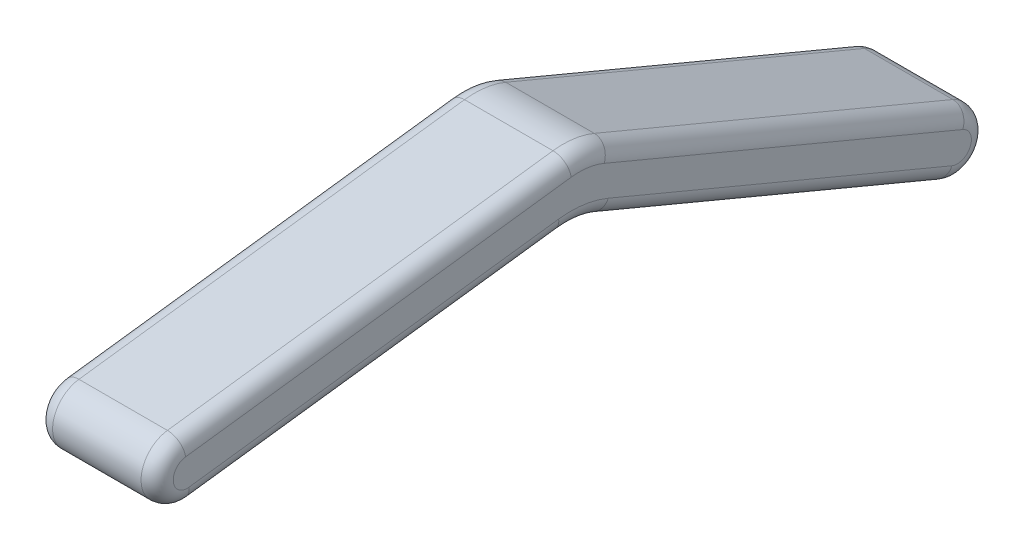
ISO-10303-21;
HEADER;
FILE_DESCRIPTION(('STEP AP214'),'2;1');
FILE_NAME('part.step','',(''),(''),'','','');
FILE_SCHEMA(('AUTOMOTIVE_DESIGN { 1 0 10303 214 1 1 1 1 }'));
ENDSEC;
DATA;
#1=APPLICATION_CONTEXT('core data for automotive mechanical design processes');
#2=APPLICATION_PROTOCOL_DEFINITION('international standard','automotive_design',2000,#1);
#3=PRODUCT_CONTEXT('',#1,'mechanical');
#4=PRODUCT('Part','Part','',(#3));
#5=PRODUCT_RELATED_PRODUCT_CATEGORY('part','',(#4));
#6=PRODUCT_DEFINITION_FORMATION('','',#4);
#7=PRODUCT_DEFINITION_CONTEXT('part definition',#1,'design');
#8=PRODUCT_DEFINITION('design','',#6,#7);
#9=PRODUCT_DEFINITION_SHAPE('','',#8);
#10=(LENGTH_UNIT() NAMED_UNIT(*) SI_UNIT(.MILLI.,.METRE.));
#11=(NAMED_UNIT(*) PLANE_ANGLE_UNIT() SI_UNIT($,.RADIAN.));
#12=(NAMED_UNIT(*) SI_UNIT($,.STERADIAN.) SOLID_ANGLE_UNIT());
#13=UNCERTAINTY_MEASURE_WITH_UNIT(LENGTH_MEASURE(1.E-05),#10,'distance_accuracy_value','');
#14=(GEOMETRIC_REPRESENTATION_CONTEXT(3) GLOBAL_UNCERTAINTY_ASSIGNED_CONTEXT((#13)) GLOBAL_UNIT_ASSIGNED_CONTEXT((#10,
#11,#12)) REPRESENTATION_CONTEXT('',''));
#15=CARTESIAN_POINT('',(0.,0.,0.));
#16=DIRECTION('',(0.,0.,1.));
#17=DIRECTION('',(1.,0.,0.));
#18=AXIS2_PLACEMENT_3D('',#15,#16,#17);
#19=CARTESIAN_POINT('',(7.5,5.18774565598026,48.0342974570473));
#20=DIRECTION('',(-1.,0.,0.));
#21=DIRECTION('',(0.,0.,1.));
#22=AXIS2_PLACEMENT_3D('',#19,#20,#21);
#23=CYLINDRICAL_SURFACE('',#22,9.99999999999999);
#24=DIRECTION('',(-1.,0.,0.));
#25=VECTOR('',#24,1.);
#26=CARTESIAN_POINT('',(7.5,14.4131959272416,44.175402888329));
#27=LINE('',#26,#25);
#28=CARTESIAN_POINT('',(5.5,14.4131959272416,44.175402888329));
#29=VERTEX_POINT('',#28);
#30=CARTESIAN_POINT('',(-5.5,14.4131959272416,44.175402888329));
#31=VERTEX_POINT('',#30);
#32=EDGE_CURVE('E165',#29,#31,#27,.T.);
#33=ORIENTED_EDGE('',*,*,#32,.F.);
#34=CARTESIAN_POINT('',(5.5,5.18774565598026,48.0342974570473));
#35=DIRECTION('',(1.,0.,0.));
#36=DIRECTION('',(0.,0.,-1.));
#37=AXIS2_PLACEMENT_3D('',#34,#35,#36);
#38=CIRCLE('',#37,9.99999999999999);
#39=CARTESIAN_POINT('',(5.5,15.1066672366018,49.3051218656422));
#40=VERTEX_POINT('',#39);
#41=EDGE_CURVE('E206',#29,#40,#38,.T.);
#42=ORIENTED_EDGE('',*,*,#41,.T.);
#43=DIRECTION('',(-1.,0.,0.));
#44=VECTOR('',#43,1.);
#45=CARTESIAN_POINT('',(7.5,15.1066672366018,49.3051218656422));
#46=LINE('',#45,#44);
#47=CARTESIAN_POINT('',(-5.5,15.1066672366018,49.3051218656422));
#48=VERTEX_POINT('',#47);
#49=EDGE_CURVE('E237',#40,#48,#46,.T.);
#50=ORIENTED_EDGE('',*,*,#49,.T.);
#51=CARTESIAN_POINT('',(-5.5,5.18774565598026,48.0342974570473));
#52=DIRECTION('',(1.,0.,0.));
#53=DIRECTION('',(0.,0.,-1.));
#54=AXIS2_PLACEMENT_3D('',#51,#52,#53);
#55=CIRCLE('',#54,9.99999999999999);
#56=EDGE_CURVE('E204',#48,#31,#55,.F.);
#57=ORIENTED_EDGE('',*,*,#56,.T.);
#58=EDGE_LOOP('',(#33,#42,#50,#57));
#59=FACE_BOUND('',#58,.T.);
#60=ADVANCED_FACE('F32',(#59),#23,.F.);
#61=CARTESIAN_POINT('',(7.5,-3.45954385172302,1.44708546326935));
#62=DIRECTION('',(0.,0.922545027126137,-0.385889456871828));
#63=DIRECTION('',(0.,0.385889456871828,0.922545027126138));
#64=AXIS2_PLACEMENT_3D('',#61,#62,#63);
#65=PLANE('',#64);
#66=DIRECTION('',(-1.,0.,0.));
#67=VECTOR('',#66,1.);
#68=CARTESIAN_POINT('',(7.5,-3.45954385172302,1.44708546326935));
#69=LINE('',#68,#67);
#70=CARTESIAN_POINT('',(5.5,-3.45954385172302,1.44708546326935));
#71=VERTEX_POINT('',#70);
#72=CARTESIAN_POINT('',(-5.5,-3.45954385172302,1.44708546326935));
#73=VERTEX_POINT('',#72);
#74=EDGE_CURVE('E292',#71,#73,#69,.T.);
#75=ORIENTED_EDGE('',*,*,#74,.F.);
#76=DIRECTION('',(0.,-0.385889456871828,-0.922545027126138));
#77=VECTOR('',#76,1.);
#78=CARTESIAN_POINT('',(5.5,14.4131959272416,44.175402888329));
#79=LINE('',#78,#77);
#80=EDGE_CURVE('E202',#71,#29,#79,.F.);
#81=ORIENTED_EDGE('',*,*,#80,.T.);
#82=ORIENTED_EDGE('',*,*,#32,.T.);
#83=DIRECTION('',(0.,-0.385889456871828,-0.922545027126138));
#84=VECTOR('',#83,1.);
#85=CARTESIAN_POINT('',(-5.5,-3.45954385172302,1.44708546326935));
#86=LINE('',#85,#84);
#87=EDGE_CURVE('E199',#31,#73,#86,.T.);
#88=ORIENTED_EDGE('',*,*,#87,.T.);
#89=EDGE_LOOP('',(#75,#81,#82,#88));
#90=FACE_BOUND('',#89,.T.);
#91=ADVANCED_FACE('F289',(#90),#65,.F.);
#92=CARTESIAN_POINT('',(7.5,0.,0.));
#93=DIRECTION('',(-1.,0.,0.));
#94=DIRECTION('',(0.,0.,1.));
#95=AXIS2_PLACEMENT_3D('',#92,#93,#94);
#96=CYLINDRICAL_SURFACE('',#95,3.75);
#97=DIRECTION('',(-1.,0.,0.));
#98=VECTOR('',#97,1.);
#99=CARTESIAN_POINT('',(7.5,3.45954385172302,-1.44708546326936));
#100=LINE('',#99,#98);
#101=CARTESIAN_POINT('',(5.5,3.45954385172302,-1.44708546326936));
#102=VERTEX_POINT('',#101);
#103=CARTESIAN_POINT('',(-5.5,3.45954385172302,-1.44708546326936));
#104=VERTEX_POINT('',#103);
#105=EDGE_CURVE('E294',#102,#104,#100,.T.);
#106=ORIENTED_EDGE('',*,*,#105,.F.);
#107=CARTESIAN_POINT('',(5.5,0.,0.));
#108=DIRECTION('',(1.,0.,0.));
#109=DIRECTION('',(0.,0.,-1.));
#110=AXIS2_PLACEMENT_3D('',#107,#108,#109);
#111=CIRCLE('',#110,3.75);
#112=EDGE_CURVE('E197',#102,#71,#111,.F.);
#113=ORIENTED_EDGE('',*,*,#112,.T.);
#114=ORIENTED_EDGE('',*,*,#74,.T.);
#115=CARTESIAN_POINT('',(-5.5,0.,0.));
#116=DIRECTION('',(1.,0.,0.));
#117=DIRECTION('',(0.,0.,-1.));
#118=AXIS2_PLACEMENT_3D('',#115,#116,#117);
#119=CIRCLE('',#118,3.75);
#120=EDGE_CURVE('E195',#73,#104,#119,.T.);
#121=ORIENTED_EDGE('',*,*,#120,.T.);
#122=EDGE_LOOP('',(#106,#113,#114,#121));
#123=FACE_BOUND('',#122,.T.);
#124=ADVANCED_FACE('F362',(#123),#96,.T.);
#125=CARTESIAN_POINT('',(7.5,3.45954385172302,-1.44708546326935));
#126=DIRECTION('',(0.,-0.922545027126137,0.385889456871828));
#127=DIRECTION('',(0.,-0.385889456871828,-0.922545027126138));
#128=AXIS2_PLACEMENT_3D('',#125,#126,#127);
#129=PLANE('',#128);
#130=DIRECTION('',(-1.,0.,0.));
#131=VECTOR('',#130,1.);
#132=CARTESIAN_POINT('',(7.5,22.1077743932113,43.1351959242888));
#133=LINE('',#132,#131);
#134=CARTESIAN_POINT('',(5.5,22.1077743932113,43.1351959242888));
#135=VERTEX_POINT('',#134);
#136=CARTESIAN_POINT('',(-5.5,22.1077743932113,43.1351959242888));
#137=VERTEX_POINT('',#136);
#138=EDGE_CURVE('E331',#135,#137,#133,.T.);
#139=ORIENTED_EDGE('',*,*,#138,.F.);
#140=DIRECTION('',(0.,0.385889456871828,0.922545027126138));
#141=VECTOR('',#140,1.);
#142=CARTESIAN_POINT('',(5.5,3.45954385172301,-1.44708546326937));
#143=LINE('',#142,#141);
#144=EDGE_CURVE('E193',#135,#102,#143,.F.);
#145=ORIENTED_EDGE('',*,*,#144,.T.);
#146=ORIENTED_EDGE('',*,*,#105,.T.);
#147=DIRECTION('',(0.,0.385889456871828,0.922545027126138));
#148=VECTOR('',#147,1.);
#149=CARTESIAN_POINT('',(-5.5,3.45954385172302,-1.44708546326935));
#150=LINE('',#149,#148);
#151=EDGE_CURVE('E191',#104,#137,#150,.T.);
#152=ORIENTED_EDGE('',*,*,#151,.T.);
#153=EDGE_LOOP('',(#139,#145,#146,#152));
#154=FACE_BOUND('',#153,.T.);
#155=ADVANCED_FACE('F338',(#154),#129,.F.);
#156=CARTESIAN_POINT('',(7.5,12.88232412195,46.9940904930071));
#157=DIRECTION('',(-1.,0.,0.));
#158=DIRECTION('',(0.,0.,1.));
#159=AXIS2_PLACEMENT_3D('',#156,#157,#158);
#160=CYLINDRICAL_SURFACE('',#159,10.);
#161=DIRECTION('',(-1.,0.,0.));
#162=VECTOR('',#161,1.);
#163=CARTESIAN_POINT('',(7.5,22.8012457025715,48.264914901602));
#164=LINE('',#163,#162);
#165=CARTESIAN_POINT('',(5.5,22.8012457025715,48.264914901602));
#166=VERTEX_POINT('',#165);
#167=CARTESIAN_POINT('',(-5.5,22.8012457025715,48.264914901602));
#168=VERTEX_POINT('',#167);
#169=EDGE_CURVE('E325',#166,#168,#164,.T.);
#170=ORIENTED_EDGE('',*,*,#169,.F.);
#171=CARTESIAN_POINT('',(5.5,12.88232412195,46.9940904930071));
#172=DIRECTION('',(1.,0.,0.));
#173=DIRECTION('',(0.,0.,-1.));
#174=AXIS2_PLACEMENT_3D('',#171,#172,#173);
#175=CIRCLE('',#174,10.);
#176=EDGE_CURVE('E189',#166,#135,#175,.F.);
#177=ORIENTED_EDGE('',*,*,#176,.T.);
#178=ORIENTED_EDGE('',*,*,#138,.T.);
#179=CARTESIAN_POINT('',(-5.5,12.88232412195,46.9940904930071));
#180=DIRECTION('',(1.,0.,0.));
#181=DIRECTION('',(0.,0.,-1.));
#182=AXIS2_PLACEMENT_3D('',#179,#180,#181);
#183=CIRCLE('',#182,10.);
#184=EDGE_CURVE('E187',#137,#168,#183,.T.);
#185=ORIENTED_EDGE('',*,*,#184,.T.);
#186=EDGE_LOOP('',(#170,#177,#178,#185));
#187=FACE_BOUND('',#186,.T.);
#188=ADVANCED_FACE('F401',(#187),#160,.T.);
#189=CARTESIAN_POINT('',(7.5,22.8012457025715,48.264914901602));
#190=DIRECTION('',(0.,-0.991892158062153,-0.127082440859488));
#191=DIRECTION('',(0.,0.127082440859488,-0.991892158062153));
#192=AXIS2_PLACEMENT_3D('',#189,#190,#191);
#193=PLANE('',#192);
#194=DIRECTION('',(-1.,0.,0.));
#195=VECTOR('',#194,1.);
#196=CARTESIAN_POINT('',(7.5,16.6599463933501,96.1984184126376));
#197=LINE('',#196,#195);
#198=CARTESIAN_POINT('',(5.5,16.6599463933501,96.1984184126376));
#199=VERTEX_POINT('',#198);
#200=CARTESIAN_POINT('',(-5.5,16.6599463933501,96.1984184126376));
#201=VERTEX_POINT('',#200);
#202=EDGE_CURVE('E323',#199,#201,#197,.T.);
#203=ORIENTED_EDGE('',*,*,#202,.F.);
#204=DIRECTION('',(0.,-0.127082440859488,0.991892158062153));
#205=VECTOR('',#204,1.);
#206=CARTESIAN_POINT('',(5.5,22.8012457025715,48.264914901602));
#207=LINE('',#206,#205);
#208=EDGE_CURVE('E185',#199,#166,#207,.F.);
#209=ORIENTED_EDGE('',*,*,#208,.T.);
#210=ORIENTED_EDGE('',*,*,#169,.T.);
#211=DIRECTION('',(0.,-0.127082440859488,0.991892158062153));
#212=VECTOR('',#211,1.);
#213=CARTESIAN_POINT('',(-5.5,22.8012457025715,48.264914901602));
#214=LINE('',#213,#212);
#215=EDGE_CURVE('E183',#168,#201,#214,.T.);
#216=ORIENTED_EDGE('',*,*,#215,.T.);
#217=EDGE_LOOP('',(#203,#209,#210,#216));
#218=FACE_BOUND('',#217,.T.);
#219=ADVANCED_FACE('F406',(#218),#193,.F.);
#220=CARTESIAN_POINT('',(7.5,12.940350800617,95.7218592594145));
#221=DIRECTION('',(-1.,0.,0.));
#222=DIRECTION('',(0.,0.,1.));
#223=AXIS2_PLACEMENT_3D('',#220,#221,#222);
#224=CYLINDRICAL_SURFACE('',#223,3.75);
#225=DIRECTION('',(-1.,0.,0.));
#226=VECTOR('',#225,1.);
#227=CARTESIAN_POINT('',(7.5,9.22075520788394,95.2453001061914));
#228=LINE('',#227,#226);
#229=CARTESIAN_POINT('',(5.5,9.22075520788394,95.2453001061914));
#230=VERTEX_POINT('',#229);
#231=CARTESIAN_POINT('',(-5.5,9.22075520788394,95.2453001061914));
#232=VERTEX_POINT('',#231);
#233=EDGE_CURVE('E321',#230,#232,#228,.T.);
#234=ORIENTED_EDGE('',*,*,#233,.F.);
#235=CARTESIAN_POINT('',(5.5,12.940350800617,95.7218592594145));
#236=DIRECTION('',(1.,0.,0.));
#237=DIRECTION('',(0.,0.,-1.));
#238=AXIS2_PLACEMENT_3D('',#235,#236,#237);
#239=CIRCLE('',#238,3.75);
#240=EDGE_CURVE('E181',#230,#199,#239,.F.);
#241=ORIENTED_EDGE('',*,*,#240,.T.);
#242=ORIENTED_EDGE('',*,*,#202,.T.);
#243=CARTESIAN_POINT('',(-5.5,12.940350800617,95.7218592594145));
#244=DIRECTION('',(1.,0.,0.));
#245=DIRECTION('',(0.,0.,-1.));
#246=AXIS2_PLACEMENT_3D('',#243,#244,#245);
#247=CIRCLE('',#246,3.75);
#248=EDGE_CURVE('E179',#201,#232,#247,.T.);
#249=ORIENTED_EDGE('',*,*,#248,.T.);
#250=EDGE_LOOP('',(#234,#241,#242,#249));
#251=FACE_BOUND('',#250,.T.);
#252=ADVANCED_FACE('F322',(#251),#224,.T.);
#253=CARTESIAN_POINT('',(7.5,15.1066672366018,49.3051218656422));
#254=DIRECTION('',(0.,0.991892158062153,0.127082440859488));
#255=DIRECTION('',(0.,-0.127082440859488,0.991892158062153));
#256=AXIS2_PLACEMENT_3D('',#253,#254,#255);
#257=PLANE('',#256);
#258=ORIENTED_EDGE('',*,*,#49,.F.);
#259=DIRECTION('',(0.,0.127082440859488,-0.991892158062153));
#260=VECTOR('',#259,1.);
#261=CARTESIAN_POINT('',(5.5,9.22075520788394,95.2453001061915));
#262=LINE('',#261,#260);
#263=EDGE_CURVE('E152',#40,#230,#262,.F.);
#264=ORIENTED_EDGE('',*,*,#263,.T.);
#265=ORIENTED_EDGE('',*,*,#233,.T.);
#266=DIRECTION('',(0.,0.127082440859488,-0.991892158062153));
#267=VECTOR('',#266,1.);
#268=CARTESIAN_POINT('',(-5.5,15.1066672366018,49.3051218656422));
#269=LINE('',#268,#267);
#270=EDGE_CURVE('E171',#232,#48,#269,.T.);
#271=ORIENTED_EDGE('',*,*,#270,.T.);
#272=EDGE_LOOP('',(#258,#264,#265,#271));
#273=FACE_BOUND('',#272,.T.);
#274=ADVANCED_FACE('F320',(#273),#257,.F.);
#275=CARTESIAN_POINT('',(7.5,5.18774565598026,48.0342974570473));
#276=DIRECTION('',(1.,0.,0.));
#277=DIRECTION('',(0.,0.,-1.));
#278=AXIS2_PLACEMENT_3D('',#275,#276,#277);
#279=PLANE('',#278);
#280=CARTESIAN_POINT('',(7.5,12.940350800617,95.7218592594145));
#281=DIRECTION('',(1.,0.,0.));
#282=DIRECTION('',(0.,0.,-1.));
#283=AXIS2_PLACEMENT_3D('',#280,#281,#282);
#284=CIRCLE('',#283,1.75);
#285=CARTESIAN_POINT('',(7.5,14.6761620772258,95.9442535309186));
#286=VERTEX_POINT('',#285);
#287=CARTESIAN_POINT('',(7.5,11.2045395240082,95.4994649879104));
#288=VERTEX_POINT('',#287);
#289=EDGE_CURVE('E169',#286,#288,#284,.T.);
#290=ORIENTED_EDGE('',*,*,#289,.T.);
#291=DIRECTION('',(0.,0.127082440859488,-0.991892158062153));
#292=VECTOR('',#291,1.);
#293=CARTESIAN_POINT('',(7.5,17.0904515527261,49.5592867473612));
#294=LINE('',#293,#292);
#295=CARTESIAN_POINT('',(7.5,17.0904515527261,49.5592867473612));
#296=VERTEX_POINT('',#295);
#297=EDGE_CURVE('E150',#288,#296,#294,.T.);
#298=ORIENTED_EDGE('',*,*,#297,.T.);
#299=CARTESIAN_POINT('',(7.5,5.18774565598026,48.0342974570473));
#300=DIRECTION('',(1.,0.,0.));
#301=DIRECTION('',(0.,0.,-1.));
#302=AXIS2_PLACEMENT_3D('',#299,#300,#301);
#303=CIRCLE('',#302,12.);
#304=CARTESIAN_POINT('',(7.5,16.2582859814939,43.4036239745853));
#305=VERTEX_POINT('',#304);
#306=EDGE_CURVE('E158',#296,#305,#303,.F.);
#307=ORIENTED_EDGE('',*,*,#306,.T.);
#308=DIRECTION('',(0.,-0.385889456871828,-0.922545027126138));
#309=VECTOR('',#308,1.);
#310=CARTESIAN_POINT('',(7.5,-1.61445379747075,0.675306549525682));
#311=LINE('',#310,#309);
#312=CARTESIAN_POINT('',(7.5,-1.61445379747074,0.675306549525699));
#313=VERTEX_POINT('',#312);
#314=EDGE_CURVE('E164',#305,#313,#311,.T.);
#315=ORIENTED_EDGE('',*,*,#314,.T.);
#316=CARTESIAN_POINT('',(7.5,0.,0.));
#317=DIRECTION('',(1.,0.,0.));
#318=DIRECTION('',(0.,0.,-1.));
#319=AXIS2_PLACEMENT_3D('',#316,#317,#318);
#320=CIRCLE('',#319,1.75);
#321=CARTESIAN_POINT('',(7.5,1.61445379747074,-0.675306549525699));
#322=VERTEX_POINT('',#321);
#323=EDGE_CURVE('E299',#313,#322,#320,.T.);
#324=ORIENTED_EDGE('',*,*,#323,.T.);
#325=DIRECTION('',(0.,0.385889456871828,0.922545027126138));
#326=VECTOR('',#325,1.);
#327=CARTESIAN_POINT('',(7.5,20.2626843389591,43.9069748380324));
#328=LINE('',#327,#326);
#329=CARTESIAN_POINT('',(7.5,20.2626843389591,43.9069748380324));
#330=VERTEX_POINT('',#329);
#331=EDGE_CURVE('E301',#322,#330,#328,.T.);
#332=ORIENTED_EDGE('',*,*,#331,.T.);
#333=CARTESIAN_POINT('',(7.5,12.88232412195,46.9940904930071));
#334=DIRECTION('',(1.,0.,0.));
#335=DIRECTION('',(0.,0.,-1.));
#336=AXIS2_PLACEMENT_3D('',#333,#334,#335);
#337=CIRCLE('',#336,8.);
#338=CARTESIAN_POINT('',(7.5,20.8174613864472,48.010750019883));
#339=VERTEX_POINT('',#338);
#340=EDGE_CURVE('E303',#330,#339,#337,.T.);
#341=ORIENTED_EDGE('',*,*,#340,.T.);
#342=DIRECTION('',(0.,-0.127082440859488,0.991892158062153));
#343=VECTOR('',#342,1.);
#344=CARTESIAN_POINT('',(7.5,14.6761620772258,95.9442535309186));
#345=LINE('',#344,#343);
#346=EDGE_CURVE('E174',#339,#286,#345,.T.);
#347=ORIENTED_EDGE('',*,*,#346,.T.);
#348=EDGE_LOOP('',(#290,#298,#307,#315,#324,#332,#341,#347));
#349=FACE_BOUND('',#348,.T.);
#350=ADVANCED_FACE('F167',(#349),#279,.T.);
#351=CARTESIAN_POINT('',(-7.5,5.18774565598026,48.0342974570473));
#352=DIRECTION('',(1.,0.,0.));
#353=DIRECTION('',(0.,0.,-1.));
#354=AXIS2_PLACEMENT_3D('',#351,#352,#353);
#355=PLANE('',#354);
#356=CARTESIAN_POINT('',(-7.5,0.,0.));
#357=DIRECTION('',(1.,0.,0.));
#358=DIRECTION('',(0.,0.,-1.));
#359=AXIS2_PLACEMENT_3D('',#356,#357,#358);
#360=CIRCLE('',#359,1.75);
#361=CARTESIAN_POINT('',(-7.5,1.61445379747074,-0.675306549525699));
#362=VERTEX_POINT('',#361);
#363=CARTESIAN_POINT('',(-7.5,-1.61445379747074,0.675306549525699));
#364=VERTEX_POINT('',#363);
#365=EDGE_CURVE('E41',#362,#364,#360,.F.);
#366=ORIENTED_EDGE('',*,*,#365,.T.);
#367=DIRECTION('',(0.,-0.385889456871828,-0.922545027126138));
#368=VECTOR('',#367,1.);
#369=CARTESIAN_POINT('',(-7.5,16.2582859814939,43.4036239745854));
#370=LINE('',#369,#368);
#371=CARTESIAN_POINT('',(-7.5,16.2582859814939,43.4036239745853));
#372=VERTEX_POINT('',#371);
#373=EDGE_CURVE('E11',#364,#372,#370,.F.);
#374=ORIENTED_EDGE('',*,*,#373,.T.);
#375=CARTESIAN_POINT('',(-7.5,5.18774565598026,48.0342974570473));
#376=DIRECTION('',(1.,0.,0.));
#377=DIRECTION('',(0.,0.,-1.));
#378=AXIS2_PLACEMENT_3D('',#375,#376,#377);
#379=CIRCLE('',#378,12.);
#380=CARTESIAN_POINT('',(-7.5,17.0904515527261,49.5592867473612));
#381=VERTEX_POINT('',#380);
#382=EDGE_CURVE('E208',#372,#381,#379,.T.);
#383=ORIENTED_EDGE('',*,*,#382,.T.);
#384=DIRECTION('',(0.,0.127082440859488,-0.991892158062153));
#385=VECTOR('',#384,1.);
#386=CARTESIAN_POINT('',(-7.5,17.0904515527261,49.5592867473612));
#387=LINE('',#386,#385);
#388=CARTESIAN_POINT('',(-7.5,11.2045395240082,95.4994649879104));
#389=VERTEX_POINT('',#388);
#390=EDGE_CURVE('E210',#381,#389,#387,.F.);
#391=ORIENTED_EDGE('',*,*,#390,.T.);
#392=CARTESIAN_POINT('',(-7.5,12.940350800617,95.7218592594145));
#393=DIRECTION('',(1.,0.,0.));
#394=DIRECTION('',(0.,0.,-1.));
#395=AXIS2_PLACEMENT_3D('',#392,#393,#394);
#396=CIRCLE('',#395,1.75);
#397=CARTESIAN_POINT('',(-7.5,14.6761620772258,95.9442535309186));
#398=VERTEX_POINT('',#397);
#399=EDGE_CURVE('E212',#389,#398,#396,.F.);
#400=ORIENTED_EDGE('',*,*,#399,.T.);
#401=DIRECTION('',(0.,-0.127082440859488,0.991892158062153));
#402=VECTOR('',#401,1.);
#403=CARTESIAN_POINT('',(-7.5,20.5620741059436,50.0040752903694));
#404=LINE('',#403,#402);
#405=CARTESIAN_POINT('',(-7.5,20.8174613864472,48.010750019883));
#406=VERTEX_POINT('',#405);
#407=EDGE_CURVE('E214',#398,#406,#404,.F.);
#408=ORIENTED_EDGE('',*,*,#407,.T.);
#409=CARTESIAN_POINT('',(-7.5,12.88232412195,46.9940904930071));
#410=DIRECTION('',(1.,0.,0.));
#411=DIRECTION('',(0.,0.,-1.));
#412=AXIS2_PLACEMENT_3D('',#409,#410,#411);
#413=CIRCLE('',#412,8.);
#414=CARTESIAN_POINT('',(-7.5,20.2626843389591,43.9069748380324));
#415=VERTEX_POINT('',#414);
#416=EDGE_CURVE('E216',#406,#415,#413,.F.);
#417=ORIENTED_EDGE('',*,*,#416,.T.);
#418=DIRECTION('',(0.,0.385889456871828,0.922545027126138));
#419=VECTOR('',#418,1.);
#420=CARTESIAN_POINT('',(-7.5,19.4871935764354,42.053010875534));
#421=LINE('',#420,#419);
#422=EDGE_CURVE('E52',#415,#362,#421,.F.);
#423=ORIENTED_EDGE('',*,*,#422,.T.);
#424=EDGE_LOOP('',(#366,#374,#383,#391,#400,#408,#417,#423));
#425=FACE_BOUND('',#424,.T.);
#426=ADVANCED_FACE('F269',(#425),#355,.F.);
#427=CARTESIAN_POINT('',(5.5,19.4871935764354,42.053010875534));
#428=DIRECTION('',(0.,-0.385889456871828,-0.922545027126138));
#429=DIRECTION('',(0.,0.922545027126137,-0.385889456871828));
#430=AXIS2_PLACEMENT_3D('',#427,#428,#429);
#431=CYLINDRICAL_SURFACE('',#430,2.);
#432=CARTESIAN_POINT('',(5.5,1.61445379747074,-0.675306549525699));
#433=DIRECTION('',(0.,-0.385889456871828,-0.922545027126137));
#434=DIRECTION('',(0.,0.922545027126138,-0.385889456871828));
#435=AXIS2_PLACEMENT_3D('',#432,#433,#434);
#436=CIRCLE('',#435,2.);
#437=EDGE_CURVE('E231',#102,#322,#436,.T.);
#438=ORIENTED_EDGE('',*,*,#437,.F.);
#439=ORIENTED_EDGE('',*,*,#144,.F.);
#440=CARTESIAN_POINT('',(5.5,20.2626843389591,43.9069748380324));
#441=DIRECTION('',(0.,0.385889456871831,0.922545027126136));
#442=DIRECTION('',(0.,-0.922545027126136,0.385889456871831));
#443=AXIS2_PLACEMENT_3D('',#440,#441,#442);
#444=CIRCLE('',#443,2.);
#445=EDGE_CURVE('E234',#330,#135,#444,.T.);
#446=ORIENTED_EDGE('',*,*,#445,.F.);
#447=ORIENTED_EDGE('',*,*,#331,.F.);
#448=EDGE_LOOP('',(#438,#439,#446,#447));
#449=FACE_BOUND('',#448,.T.);
#450=ADVANCED_FACE('F384',(#449),#431,.T.);
#451=CARTESIAN_POINT('',(5.5,12.88232412195,46.9940904930071));
#452=DIRECTION('',(1.,0.,0.));
#453=DIRECTION('',(0.,0.,-1.));
#454=AXIS2_PLACEMENT_3D('',#451,#452,#453);
#455=TOROIDAL_SURFACE('',#454,8.,2.);
#456=ORIENTED_EDGE('',*,*,#445,.T.);
#457=ORIENTED_EDGE('',*,*,#176,.F.);
#458=CARTESIAN_POINT('',(5.5,20.8174613864472,48.010750019883));
#459=DIRECTION('',(0.,-0.127082440859488,0.991892158062153));
#460=DIRECTION('',(0.,-0.991892158062153,-0.127082440859488));
#461=AXIS2_PLACEMENT_3D('',#458,#459,#460);
#462=CIRCLE('',#461,2.);
#463=EDGE_CURVE('E228',#339,#166,#462,.T.);
#464=ORIENTED_EDGE('',*,*,#463,.F.);
#465=ORIENTED_EDGE('',*,*,#340,.F.);
#466=EDGE_LOOP('',(#456,#457,#464,#465));
#467=FACE_BOUND('',#466,.T.);
#468=ADVANCED_FACE('F381',(#467),#455,.T.);
#469=CARTESIAN_POINT('',(5.5,0.,0.));
#470=DIRECTION('',(1.,0.,0.));
#471=DIRECTION('',(0.,0.,-1.));
#472=AXIS2_PLACEMENT_3D('',#469,#470,#471);
#473=DEGENERATE_TOROIDAL_SURFACE('',#472,1.75,2.,.T.);
#474=ORIENTED_EDGE('',*,*,#437,.T.);
#475=ORIENTED_EDGE('',*,*,#323,.F.);
#476=CARTESIAN_POINT('',(5.5,-1.61445379747074,0.675306549525699));
#477=DIRECTION('',(0.,0.385889456871828,0.922545027126137));
#478=DIRECTION('',(0.,-0.922545027126138,0.385889456871828));
#479=AXIS2_PLACEMENT_3D('',#476,#477,#478);
#480=CIRCLE('',#479,2.);
#481=EDGE_CURVE('E225',#71,#313,#480,.T.);
#482=ORIENTED_EDGE('',*,*,#481,.F.);
#483=ORIENTED_EDGE('',*,*,#112,.F.);
#484=EDGE_LOOP('',(#474,#475,#482,#483));
#485=FACE_BOUND('',#484,.T.);
#486=ADVANCED_FACE('F378',(#485),#473,.T.);
#487=CARTESIAN_POINT('',(5.5,20.5620741059436,50.0040752903694));
#488=DIRECTION('',(0.,0.127082440859488,-0.991892158062153));
#489=DIRECTION('',(0.,0.991892158062153,0.127082440859488));
#490=AXIS2_PLACEMENT_3D('',#487,#488,#489);
#491=CYLINDRICAL_SURFACE('',#490,2.);
#492=ORIENTED_EDGE('',*,*,#463,.T.);
#493=ORIENTED_EDGE('',*,*,#208,.F.);
#494=CARTESIAN_POINT('',(5.5,14.6761620772258,95.9442535309186));
#495=DIRECTION('',(0.,-0.127082440859488,0.991892158062153));
#496=DIRECTION('',(0.,-0.991892158062153,-0.127082440859488));
#497=AXIS2_PLACEMENT_3D('',#494,#495,#496);
#498=CIRCLE('',#497,2.);
#499=EDGE_CURVE('E222',#286,#199,#498,.T.);
#500=ORIENTED_EDGE('',*,*,#499,.F.);
#501=ORIENTED_EDGE('',*,*,#346,.F.);
#502=EDGE_LOOP('',(#492,#493,#500,#501));
#503=FACE_BOUND('',#502,.T.);
#504=ADVANCED_FACE('F310',(#503),#491,.T.);
#505=CARTESIAN_POINT('',(5.5,16.2582859814939,43.4036239745854));
#506=DIRECTION('',(0.,0.385889456871828,0.922545027126138));
#507=DIRECTION('',(0.,-0.922545027126137,0.385889456871828));
#508=AXIS2_PLACEMENT_3D('',#505,#506,#507);
#509=CYLINDRICAL_SURFACE('',#508,2.);
#510=ORIENTED_EDGE('',*,*,#481,.T.);
#511=ORIENTED_EDGE('',*,*,#314,.F.);
#512=CARTESIAN_POINT('',(5.5,16.2582859814939,43.4036239745853));
#513=DIRECTION('',(0.,0.385889456871829,0.922545027126137));
#514=DIRECTION('',(0.,-0.922545027126137,0.385889456871829));
#515=AXIS2_PLACEMENT_3D('',#512,#513,#514);
#516=CIRCLE('',#515,2.);
#517=EDGE_CURVE('E161',#29,#305,#516,.T.);
#518=ORIENTED_EDGE('',*,*,#517,.F.);
#519=ORIENTED_EDGE('',*,*,#80,.F.);
#520=EDGE_LOOP('',(#510,#511,#518,#519));
#521=FACE_BOUND('',#520,.T.);
#522=ADVANCED_FACE('F372',(#521),#509,.T.);
#523=CARTESIAN_POINT('',(5.5,12.940350800617,95.7218592594145));
#524=DIRECTION('',(1.,0.,0.));
#525=DIRECTION('',(0.,0.,-1.));
#526=AXIS2_PLACEMENT_3D('',#523,#524,#525);
#527=DEGENERATE_TOROIDAL_SURFACE('',#526,1.75,2.,.T.);
#528=ORIENTED_EDGE('',*,*,#499,.T.);
#529=ORIENTED_EDGE('',*,*,#240,.F.);
#530=CARTESIAN_POINT('',(5.5,11.2045395240082,95.4994649879104));
#531=DIRECTION('',(0.,0.127082440859488,-0.991892158062153));
#532=DIRECTION('',(0.,0.991892158062153,0.127082440859488));
#533=AXIS2_PLACEMENT_3D('',#530,#531,#532);
#534=CIRCLE('',#533,2.);
#535=EDGE_CURVE('E155',#288,#230,#534,.T.);
#536=ORIENTED_EDGE('',*,*,#535,.F.);
#537=ORIENTED_EDGE('',*,*,#289,.F.);
#538=EDGE_LOOP('',(#528,#529,#536,#537));
#539=FACE_BOUND('',#538,.T.);
#540=ADVANCED_FACE('F313',(#539),#527,.T.);
#541=CARTESIAN_POINT('',(5.5,5.18774565598026,48.0342974570473));
#542=DIRECTION('',(1.,0.,0.));
#543=DIRECTION('',(0.,0.,-1.));
#544=AXIS2_PLACEMENT_3D('',#541,#542,#543);
#545=TOROIDAL_SURFACE('',#544,12.,2.);
#546=ORIENTED_EDGE('',*,*,#517,.T.);
#547=ORIENTED_EDGE('',*,*,#306,.F.);
#548=CARTESIAN_POINT('',(5.5,17.0904515527261,49.5592867473612));
#549=DIRECTION('',(0.,-0.127082440859492,0.991892158062152));
#550=DIRECTION('',(0.,-0.991892158062152,-0.127082440859492));
#551=AXIS2_PLACEMENT_3D('',#548,#549,#550);
#552=CIRCLE('',#551,2.);
#553=EDGE_CURVE('E146',#40,#296,#552,.T.);
#554=ORIENTED_EDGE('',*,*,#553,.F.);
#555=ORIENTED_EDGE('',*,*,#41,.F.);
#556=EDGE_LOOP('',(#546,#547,#554,#555));
#557=FACE_BOUND('',#556,.T.);
#558=ADVANCED_FACE('F159',(#557),#545,.T.);
#559=CARTESIAN_POINT('',(5.5,17.0904515527261,49.5592867473612));
#560=DIRECTION('',(0.,-0.127082440859488,0.991892158062153));
#561=DIRECTION('',(0.,-0.991892158062153,-0.127082440859488));
#562=AXIS2_PLACEMENT_3D('',#559,#560,#561);
#563=CYLINDRICAL_SURFACE('',#562,2.);
#564=ORIENTED_EDGE('',*,*,#535,.T.);
#565=ORIENTED_EDGE('',*,*,#263,.F.);
#566=ORIENTED_EDGE('',*,*,#553,.T.);
#567=ORIENTED_EDGE('',*,*,#297,.F.);
#568=EDGE_LOOP('',(#564,#565,#566,#567));
#569=FACE_BOUND('',#568,.T.);
#570=ADVANCED_FACE('F148',(#569),#563,.T.);
#571=CARTESIAN_POINT('',(-5.5,20.8174613864472,48.010750019883));
#572=DIRECTION('',(0.,-0.127082440859488,0.991892158062153));
#573=DIRECTION('',(0.,-0.991892158062153,-0.127082440859488));
#574=AXIS2_PLACEMENT_3D('',#571,#572,#573);
#575=CYLINDRICAL_SURFACE('',#574,2.);
#576=CARTESIAN_POINT('',(-5.5,20.8174613864472,48.010750019883));
#577=DIRECTION('',(0.,0.127082440859492,-0.991892158062152));
#578=DIRECTION('',(0.,0.991892158062152,0.127082440859492));
#579=AXIS2_PLACEMENT_3D('',#576,#577,#578);
#580=CIRCLE('',#579,2.);
#581=EDGE_CURVE('E253',#406,#168,#580,.T.);
#582=ORIENTED_EDGE('',*,*,#581,.F.);
#583=ORIENTED_EDGE('',*,*,#407,.F.);
#584=CARTESIAN_POINT('',(-5.5,14.6761620772258,95.9442535309186));
#585=DIRECTION('',(0.,-0.127082440859488,0.991892158062153));
#586=DIRECTION('',(0.,-0.991892158062153,-0.127082440859488));
#587=AXIS2_PLACEMENT_3D('',#584,#585,#586);
#588=CIRCLE('',#587,2.);
#589=EDGE_CURVE('E36',#201,#398,#588,.T.);
#590=ORIENTED_EDGE('',*,*,#589,.F.);
#591=ORIENTED_EDGE('',*,*,#215,.F.);
#592=EDGE_LOOP('',(#582,#583,#590,#591));
#593=FACE_BOUND('',#592,.T.);
#594=ADVANCED_FACE('F34',(#593),#575,.T.);
#595=CARTESIAN_POINT('',(-5.5,12.940350800617,95.7218592594145));
#596=DIRECTION('',(1.,0.,0.));
#597=DIRECTION('',(0.,0.,-1.));
#598=AXIS2_PLACEMENT_3D('',#595,#596,#597);
#599=DEGENERATE_TOROIDAL_SURFACE('',#598,1.75,2.,.T.);
#600=ORIENTED_EDGE('',*,*,#589,.T.);
#601=ORIENTED_EDGE('',*,*,#399,.F.);
#602=CARTESIAN_POINT('',(-5.5,11.2045395240082,95.4994649879104));
#603=DIRECTION('',(0.,0.127082440859488,-0.991892158062153));
#604=DIRECTION('',(0.,0.991892158062153,0.127082440859488));
#605=AXIS2_PLACEMENT_3D('',#602,#603,#604);
#606=CIRCLE('',#605,2.);
#607=EDGE_CURVE('E251',#232,#389,#606,.T.);
#608=ORIENTED_EDGE('',*,*,#607,.F.);
#609=ORIENTED_EDGE('',*,*,#248,.F.);
#610=EDGE_LOOP('',(#600,#601,#608,#609));
#611=FACE_BOUND('',#610,.T.);
#612=ADVANCED_FACE('F264',(#611),#599,.T.);
#613=CARTESIAN_POINT('',(-5.5,12.88232412195,46.9940904930071));
#614=DIRECTION('',(1.,0.,0.));
#615=DIRECTION('',(0.,0.,-1.));
#616=AXIS2_PLACEMENT_3D('',#613,#614,#615);
#617=TOROIDAL_SURFACE('',#616,8.,2.);
#618=ORIENTED_EDGE('',*,*,#581,.T.);
#619=ORIENTED_EDGE('',*,*,#184,.F.);
#620=CARTESIAN_POINT('',(-5.5,20.2626843389591,43.9069748380324));
#621=DIRECTION('',(0.,-0.385889456871828,-0.922545027126137));
#622=DIRECTION('',(0.,0.922545027126137,-0.385889456871829));
#623=AXIS2_PLACEMENT_3D('',#620,#621,#622);
#624=CIRCLE('',#623,2.);
#625=EDGE_CURVE('E248',#415,#137,#624,.T.);
#626=ORIENTED_EDGE('',*,*,#625,.F.);
#627=ORIENTED_EDGE('',*,*,#416,.F.);
#628=EDGE_LOOP('',(#618,#619,#626,#627));
#629=FACE_BOUND('',#628,.T.);
#630=ADVANCED_FACE('F486',(#629),#617,.T.);
#631=CARTESIAN_POINT('',(-5.5,17.0904515527261,49.5592867473612));
#632=DIRECTION('',(0.,0.127082440859488,-0.991892158062153));
#633=DIRECTION('',(0.,0.991892158062153,0.127082440859488));
#634=AXIS2_PLACEMENT_3D('',#631,#632,#633);
#635=CYLINDRICAL_SURFACE('',#634,2.);
#636=ORIENTED_EDGE('',*,*,#607,.T.);
#637=ORIENTED_EDGE('',*,*,#390,.F.);
#638=CARTESIAN_POINT('',(-5.5,17.0904515527261,49.5592867473612));
#639=DIRECTION('',(0.,0.127082440859488,-0.991892158062153));
#640=DIRECTION('',(0.,0.991892158062153,0.127082440859488));
#641=AXIS2_PLACEMENT_3D('',#638,#639,#640);
#642=CIRCLE('',#641,2.);
#643=EDGE_CURVE('E245',#48,#381,#642,.T.);
#644=ORIENTED_EDGE('',*,*,#643,.F.);
#645=ORIENTED_EDGE('',*,*,#270,.F.);
#646=EDGE_LOOP('',(#636,#637,#644,#645));
#647=FACE_BOUND('',#646,.T.);
#648=ADVANCED_FACE('F275',(#647),#635,.T.);
#649=CARTESIAN_POINT('',(-5.5,1.61445379747074,-0.675306549525699));
#650=DIRECTION('',(0.,0.385889456871828,0.922545027126138));
#651=DIRECTION('',(0.,-0.922545027126137,0.385889456871828));
#652=AXIS2_PLACEMENT_3D('',#649,#650,#651);
#653=CYLINDRICAL_SURFACE('',#652,2.);
#654=ORIENTED_EDGE('',*,*,#625,.T.);
#655=ORIENTED_EDGE('',*,*,#151,.F.);
#656=CARTESIAN_POINT('',(-5.5,1.61445379747074,-0.675306549525699));
#657=DIRECTION('',(0.,-0.385889456871828,-0.922545027126137));
#658=DIRECTION('',(0.,0.922545027126138,-0.385889456871828));
#659=AXIS2_PLACEMENT_3D('',#656,#657,#658);
#660=CIRCLE('',#659,2.);
#661=EDGE_CURVE('E242',#362,#104,#660,.T.);
#662=ORIENTED_EDGE('',*,*,#661,.F.);
#663=ORIENTED_EDGE('',*,*,#422,.F.);
#664=EDGE_LOOP('',(#654,#655,#662,#663));
#665=FACE_BOUND('',#664,.T.);
#666=ADVANCED_FACE('F343',(#665),#653,.T.);
#667=CARTESIAN_POINT('',(-5.5,5.18774565598026,48.0342974570473));
#668=DIRECTION('',(1.,0.,0.));
#669=DIRECTION('',(0.,0.,-1.));
#670=AXIS2_PLACEMENT_3D('',#667,#668,#669);
#671=TOROIDAL_SURFACE('',#670,12.,2.);
#672=ORIENTED_EDGE('',*,*,#643,.T.);
#673=ORIENTED_EDGE('',*,*,#382,.F.);
#674=CARTESIAN_POINT('',(-5.5,16.2582859814939,43.4036239745853));
#675=DIRECTION('',(0.,-0.385889456871832,-0.922545027126136));
#676=DIRECTION('',(0.,0.922545027126136,-0.385889456871832));
#677=AXIS2_PLACEMENT_3D('',#674,#675,#676);
#678=CIRCLE('',#677,2.);
#679=EDGE_CURVE('E240',#31,#372,#678,.T.);
#680=ORIENTED_EDGE('',*,*,#679,.F.);
#681=ORIENTED_EDGE('',*,*,#56,.F.);
#682=EDGE_LOOP('',(#672,#673,#680,#681));
#683=FACE_BOUND('',#682,.T.);
#684=ADVANCED_FACE('F279',(#683),#671,.T.);
#685=CARTESIAN_POINT('',(-5.5,0.,0.));
#686=DIRECTION('',(1.,0.,0.));
#687=DIRECTION('',(0.,0.,-1.));
#688=AXIS2_PLACEMENT_3D('',#685,#686,#687);
#689=DEGENERATE_TOROIDAL_SURFACE('',#688,1.75,2.,.T.);
#690=ORIENTED_EDGE('',*,*,#661,.T.);
#691=ORIENTED_EDGE('',*,*,#120,.F.);
#692=CARTESIAN_POINT('',(-5.5,-1.61445379747074,0.675306549525699));
#693=DIRECTION('',(0.,0.385889456871828,0.922545027126137));
#694=DIRECTION('',(0.,-0.922545027126138,0.385889456871828));
#695=AXIS2_PLACEMENT_3D('',#692,#693,#694);
#696=CIRCLE('',#695,2.);
#697=EDGE_CURVE('E238',#364,#73,#696,.T.);
#698=ORIENTED_EDGE('',*,*,#697,.F.);
#699=ORIENTED_EDGE('',*,*,#365,.F.);
#700=EDGE_LOOP('',(#690,#691,#698,#699));
#701=FACE_BOUND('',#700,.T.);
#702=ADVANCED_FACE('F346',(#701),#689,.T.);
#703=CARTESIAN_POINT('',(-5.5,-1.61445379747074,0.675306549525699));
#704=DIRECTION('',(0.,-0.385889456871828,-0.922545027126138));
#705=DIRECTION('',(0.,0.922545027126137,-0.385889456871828));
#706=AXIS2_PLACEMENT_3D('',#703,#704,#705);
#707=CYLINDRICAL_SURFACE('',#706,2.);
#708=ORIENTED_EDGE('',*,*,#679,.T.);
#709=ORIENTED_EDGE('',*,*,#373,.F.);
#710=ORIENTED_EDGE('',*,*,#697,.T.);
#711=ORIENTED_EDGE('',*,*,#87,.F.);
#712=EDGE_LOOP('',(#708,#709,#710,#711));
#713=FACE_BOUND('',#712,.T.);
#714=ADVANCED_FACE('F349',(#713),#707,.T.);
#715=CLOSED_SHELL('',(#60,#91,#124,#155,#188,#219,#252,#274,#350,#426,#450,#468,#486,#504,#522,
#540,#558,#570,#594,#612,#630,#648,#666,#684,#702,#714));
#716=MANIFOLD_SOLID_BREP('B2',#715);
#717=ADVANCED_BREP_SHAPE_REPRESENTATION('',(#18,#716),#14);
#718=SHAPE_DEFINITION_REPRESENTATION(#9,#717);
ENDSEC;
END-ISO-10303-21;
